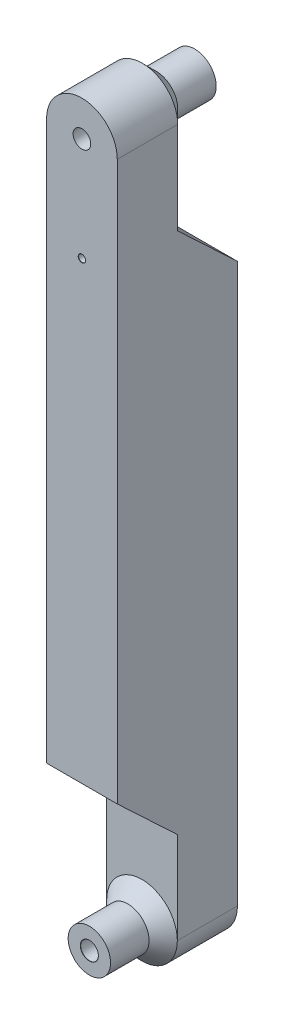
ISO-10303-21;
HEADER;
FILE_DESCRIPTION(('STEP AP214'),'2;1');
FILE_NAME('part.step','',(''),(''),'','','');
FILE_SCHEMA(('AUTOMOTIVE_DESIGN { 1 0 10303 214 1 1 1 1 }'));
ENDSEC;
DATA;
#1=APPLICATION_CONTEXT('core data for automotive mechanical design processes');
#2=APPLICATION_PROTOCOL_DEFINITION('international standard','automotive_design',2000,#1);
#3=PRODUCT_CONTEXT('',#1,'mechanical');
#4=PRODUCT('Part','Part','',(#3));
#5=PRODUCT_RELATED_PRODUCT_CATEGORY('part','',(#4));
#6=PRODUCT_DEFINITION_FORMATION('','',#4);
#7=PRODUCT_DEFINITION_CONTEXT('part definition',#1,'design');
#8=PRODUCT_DEFINITION('design','',#6,#7);
#9=PRODUCT_DEFINITION_SHAPE('','',#8);
#10=(LENGTH_UNIT() NAMED_UNIT(*) SI_UNIT(.MILLI.,.METRE.));
#11=(NAMED_UNIT(*) PLANE_ANGLE_UNIT() SI_UNIT($,.RADIAN.));
#12=(NAMED_UNIT(*) SI_UNIT($,.STERADIAN.) SOLID_ANGLE_UNIT());
#13=UNCERTAINTY_MEASURE_WITH_UNIT(LENGTH_MEASURE(1.E-05),#10,'distance_accuracy_value','');
#14=(GEOMETRIC_REPRESENTATION_CONTEXT(3) GLOBAL_UNCERTAINTY_ASSIGNED_CONTEXT((#13)) GLOBAL_UNIT_ASSIGNED_CONTEXT((#10,
#11,#12)) REPRESENTATION_CONTEXT('',''));
#15=CARTESIAN_POINT('',(0.,0.,0.));
#16=DIRECTION('',(0.,0.,1.));
#17=DIRECTION('',(1.,0.,0.));
#18=AXIS2_PLACEMENT_3D('',#15,#16,#17);
#19=CARTESIAN_POINT('',(0.,50.,-8.5));
#20=DIRECTION('',(0.,0.,-1.));
#21=DIRECTION('',(-1.,0.,0.));
#22=AXIS2_PLACEMENT_3D('',#19,#20,#21);
#23=PLANE('',#22);
#24=DIRECTION('',(1.,0.,0.));
#25=VECTOR('',#24,1.);
#26=CARTESIAN_POINT('',(-5.,29.,-8.5));
#27=LINE('',#26,#25);
#28=CARTESIAN_POINT('',(-5.,29.,-8.5));
#29=VERTEX_POINT('',#28);
#30=CARTESIAN_POINT('',(5.00000000000001,29.,-8.5));
#31=VERTEX_POINT('',#30);
#32=EDGE_CURVE('E135',#29,#31,#27,.T.);
#33=ORIENTED_EDGE('',*,*,#32,.T.);
#34=DIRECTION('',(0.,1.,0.));
#35=VECTOR('',#34,1.);
#36=CARTESIAN_POINT('',(5.00000000000001,-50.,-8.5));
#37=LINE('',#36,#35);
#38=CARTESIAN_POINT('',(5.00000000000001,-50.,-8.5));
#39=VERTEX_POINT('',#38);
#40=EDGE_CURVE('E167',#39,#31,#37,.T.);
#41=ORIENTED_EDGE('',*,*,#40,.F.);
#42=CARTESIAN_POINT('',(0.,-50.,-8.5));
#43=DIRECTION('',(0.,0.,1.));
#44=DIRECTION('',(-1.,0.,0.));
#45=AXIS2_PLACEMENT_3D('',#42,#43,#44);
#46=CIRCLE('',#45,5.);
#47=CARTESIAN_POINT('',(-4.99999999999999,-50.,-8.5));
#48=VERTEX_POINT('',#47);
#49=EDGE_CURVE('E173',#48,#39,#46,.T.);
#50=ORIENTED_EDGE('',*,*,#49,.F.);
#51=DIRECTION('',(0.,-1.,0.));
#52=VECTOR('',#51,1.);
#53=CARTESIAN_POINT('',(-4.99999999999999,-50.,-8.5));
#54=LINE('',#53,#52);
#55=EDGE_CURVE('E162',#29,#48,#54,.T.);
#56=ORIENTED_EDGE('',*,*,#55,.F.);
#57=EDGE_LOOP('',(#33,#41,#50,#56));
#58=FACE_BOUND('',#57,.T.);
#59=CARTESIAN_POINT('',(0.,-50.,-8.5));
#60=DIRECTION('',(0.,0.,1.));
#61=DIRECTION('',(1.,0.,0.));
#62=AXIS2_PLACEMENT_3D('',#59,#60,#61);
#63=CIRCLE('',#62,1.25);
#64=CARTESIAN_POINT('',(1.25,-50.,-8.5));
#65=VERTEX_POINT('',#64);
#66=EDGE_CURVE('E322',#65,#65,#63,.T.);
#67=ORIENTED_EDGE('',*,*,#66,.T.);
#68=EDGE_LOOP('',(#67));
#69=FACE_BOUND('',#68,.T.);
#70=ADVANCED_FACE('F41',(#58,#69),#23,.T.);
#71=CARTESIAN_POINT('',(0.,50.,8.5));
#72=DIRECTION('',(0.,0.,-1.));
#73=DIRECTION('',(-1.,0.,0.));
#74=AXIS2_PLACEMENT_3D('',#71,#72,#73);
#75=CYLINDRICAL_SURFACE('',#74,5.);
#76=DIRECTION('',(0.,0.,-1.));
#77=VECTOR('',#76,1.);
#78=CARTESIAN_POINT('',(5.00000000000001,50.,8.5));
#79=LINE('',#78,#77);
#80=CARTESIAN_POINT('',(5.00000000000001,50.,8.5));
#81=VERTEX_POINT('',#80);
#82=CARTESIAN_POINT('',(5.00000000000001,50.,-0.0500000000000066));
#83=VERTEX_POINT('',#82);
#84=EDGE_CURVE('E65',#81,#83,#79,.T.);
#85=ORIENTED_EDGE('',*,*,#84,.T.);
#86=CARTESIAN_POINT('',(0.,50.,-0.0500000000000079));
#87=DIRECTION('',(0.,0.,1.));
#88=DIRECTION('',(1.,0.,0.));
#89=AXIS2_PLACEMENT_3D('',#86,#87,#88);
#90=CIRCLE('',#89,5.);
#91=CARTESIAN_POINT('',(-4.99999999999999,50.,-0.0500000000000084));
#92=VERTEX_POINT('',#91);
#93=EDGE_CURVE('E200',#83,#92,#90,.T.);
#94=ORIENTED_EDGE('',*,*,#93,.T.);
#95=DIRECTION('',(0.,0.,-1.));
#96=VECTOR('',#95,1.);
#97=CARTESIAN_POINT('',(-4.99999999999999,50.,8.5));
#98=LINE('',#97,#96);
#99=CARTESIAN_POINT('',(-4.99999999999999,50.,8.5));
#100=VERTEX_POINT('',#99);
#101=EDGE_CURVE('E58',#100,#92,#98,.T.);
#102=ORIENTED_EDGE('',*,*,#101,.F.);
#103=CARTESIAN_POINT('',(0.,50.,8.5));
#104=DIRECTION('',(0.,0.,1.));
#105=DIRECTION('',(-1.,0.,0.));
#106=AXIS2_PLACEMENT_3D('',#103,#104,#105);
#107=CIRCLE('',#106,5.);
#108=EDGE_CURVE('E163',#81,#100,#107,.T.);
#109=ORIENTED_EDGE('',*,*,#108,.F.);
#110=EDGE_LOOP('',(#85,#94,#102,#109));
#111=FACE_BOUND('',#110,.T.);
#112=ADVANCED_FACE('F216',(#111),#75,.T.);
#113=CARTESIAN_POINT('',(-4.99999999999999,-50.,8.5));
#114=DIRECTION('',(1.,0.,0.));
#115=DIRECTION('',(0.,0.,-1.));
#116=AXIS2_PLACEMENT_3D('',#113,#114,#115);
#117=PLANE('',#116);
#118=ORIENTED_EDGE('',*,*,#101,.T.);
#119=CARTESIAN_POINT('',(-4.99999999999999,50.,-0.050000000000008));
#120=CARTESIAN_POINT('',(-4.99999999999999,49.9406950912656,-0.0500030855515016));
#121=CARTESIAN_POINT('',(-4.99999999999999,49.8813907917663,-0.0489448908370419));
#122=CARTESIAN_POINT('',(-4.99999999999999,49.7629290319382,-0.0447316902668953));
#123=CARTESIAN_POINT('',(-4.99999999999999,49.7037714807349,-0.0415792434171539));
#124=CARTESIAN_POINT('',(-4.99999999999999,49.5856050710497,-0.0332032684096867));
#125=CARTESIAN_POINT('',(-4.99999999999999,49.5265962094341,-0.0279797842740843));
#126=CARTESIAN_POINT('',(-4.99999999999999,49.4087204290817,-0.0155023969568519));
#127=CARTESIAN_POINT('',(-4.99999999999999,49.3498537716871,-0.00824602201829422));
#128=CARTESIAN_POINT('',(-4.99999999999999,49.2911276560621,0.));
#129=B_SPLINE_CURVE_WITH_KNOTS('',3,(#119,#120,#121,#122,#123,#124,#125,#126,#127,#128),
.UNSPECIFIED.,.F.,.F.,(4,2,2,2,4),(0.,0.177904351415449,0.355591717032738,0.533275305916565,
0.711175881922022),.UNSPECIFIED.);
#130=CARTESIAN_POINT('',(-5.,49.2911276560621,0.));
#131=VERTEX_POINT('',#130);
#132=EDGE_CURVE('E122',#92,#131,#129,.T.);
#133=ORIENTED_EDGE('',*,*,#132,.T.);
#134=DIRECTION('',(0.,-1.,0.));
#135=VECTOR('',#134,1.);
#136=CARTESIAN_POINT('',(-5.,55.,0.));
#137=LINE('',#136,#135);
#138=CARTESIAN_POINT('',(-5.,37.,0.));
#139=VERTEX_POINT('',#138);
#140=EDGE_CURVE('E114',#131,#139,#137,.T.);
#141=ORIENTED_EDGE('',*,*,#140,.T.);
#142=DIRECTION('',(0.,-0.685364699004991,-0.728199992692803));
#143=VECTOR('',#142,1.);
#144=CARTESIAN_POINT('',(-5.,37.,0.));
#145=LINE('',#144,#143);
#146=EDGE_CURVE('E119',#139,#29,#145,.T.);
#147=ORIENTED_EDGE('',*,*,#146,.T.);
#148=ORIENTED_EDGE('',*,*,#55,.T.);
#149=DIRECTION('',(0.,0.,-1.));
#150=VECTOR('',#149,1.);
#151=CARTESIAN_POINT('',(-4.99999999999999,-50.,8.5));
#152=LINE('',#151,#150);
#153=CARTESIAN_POINT('',(-5.,-50.,0.));
#154=VERTEX_POINT('',#153);
#155=EDGE_CURVE('E181',#154,#48,#152,.T.);
#156=ORIENTED_EDGE('',*,*,#155,.F.);
#157=DIRECTION('',(0.,1.,0.));
#158=VECTOR('',#157,1.);
#159=CARTESIAN_POINT('',(-5.,-37.,0.));
#160=LINE('',#159,#158);
#161=CARTESIAN_POINT('',(-5.,-37.,0.));
#162=VERTEX_POINT('',#161);
#163=EDGE_CURVE('E147',#154,#162,#160,.T.);
#164=ORIENTED_EDGE('',*,*,#163,.T.);
#165=DIRECTION('',(0.,0.685364699004991,0.728199992692803));
#166=VECTOR('',#165,1.);
#167=CARTESIAN_POINT('',(-5.,-29.,8.5));
#168=LINE('',#167,#166);
#169=CARTESIAN_POINT('',(-5.,-29.,8.5));
#170=VERTEX_POINT('',#169);
#171=EDGE_CURVE('E126',#162,#170,#168,.T.);
#172=ORIENTED_EDGE('',*,*,#171,.T.);
#173=DIRECTION('',(0.,-1.,0.));
#174=VECTOR('',#173,1.);
#175=CARTESIAN_POINT('',(-4.99999999999999,-50.,8.5));
#176=LINE('',#175,#174);
#177=EDGE_CURVE('E166',#100,#170,#176,.T.);
#178=ORIENTED_EDGE('',*,*,#177,.F.);
#179=EDGE_LOOP('',(#118,#133,#141,#147,#148,#156,#164,#172,#178));
#180=FACE_BOUND('',#179,.T.);
#181=ADVANCED_FACE('F116',(#180),#117,.F.);
#182=CARTESIAN_POINT('',(0.,-50.,8.5));
#183=DIRECTION('',(0.,0.,-1.));
#184=DIRECTION('',(-1.,0.,0.));
#185=AXIS2_PLACEMENT_3D('',#182,#183,#184);
#186=CYLINDRICAL_SURFACE('',#185,5.);
#187=DIRECTION('',(0.,0.,-1.));
#188=VECTOR('',#187,1.);
#189=CARTESIAN_POINT('',(5.00000000000001,-50.,8.5));
#190=LINE('',#189,#188);
#191=CARTESIAN_POINT('',(5.00000000000001,-50.,0.));
#192=VERTEX_POINT('',#191);
#193=EDGE_CURVE('E179',#192,#39,#190,.T.);
#194=ORIENTED_EDGE('',*,*,#193,.F.);
#195=CARTESIAN_POINT('',(0.,-50.,0.));
#196=DIRECTION('',(0.,0.,-1.));
#197=DIRECTION('',(-1.,0.,0.));
#198=AXIS2_PLACEMENT_3D('',#195,#196,#197);
#199=CIRCLE('',#198,5.);
#200=EDGE_CURVE('E160',#192,#154,#199,.T.);
#201=ORIENTED_EDGE('',*,*,#200,.T.);
#202=ORIENTED_EDGE('',*,*,#155,.T.);
#203=ORIENTED_EDGE('',*,*,#49,.T.);
#204=EDGE_LOOP('',(#194,#201,#202,#203));
#205=FACE_BOUND('',#204,.T.);
#206=ADVANCED_FACE('F226',(#205),#186,.T.);
#207=CARTESIAN_POINT('',(5.00000000000001,-50.,8.5));
#208=DIRECTION('',(-1.,0.,0.));
#209=DIRECTION('',(0.,0.,1.));
#210=AXIS2_PLACEMENT_3D('',#207,#208,#209);
#211=PLANE('',#210);
#212=ORIENTED_EDGE('',*,*,#40,.T.);
#213=DIRECTION('',(0.,0.685364699004991,0.728199992692803));
#214=VECTOR('',#213,1.);
#215=CARTESIAN_POINT('',(5.00000000000001,0.376146788990846,-38.9128440366972));
#216=LINE('',#215,#214);
#217=CARTESIAN_POINT('',(5.00000000000001,37.,0.));
#218=VERTEX_POINT('',#217);
#219=EDGE_CURVE('E142',#31,#218,#216,.T.);
#220=ORIENTED_EDGE('',*,*,#219,.T.);
#221=DIRECTION('',(0.,1.,0.));
#222=VECTOR('',#221,1.);
#223=CARTESIAN_POINT('',(5.00000000000001,-50.,0.));
#224=LINE('',#223,#222);
#225=CARTESIAN_POINT('',(5.00000000000001,49.2911276560621,0.));
#226=VERTEX_POINT('',#225);
#227=EDGE_CURVE('E132',#218,#226,#224,.T.);
#228=ORIENTED_EDGE('',*,*,#227,.T.);
#229=CARTESIAN_POINT('',(5.00000000000001,49.2911276560621,0.));
#230=CARTESIAN_POINT('',(5.00000000000001,49.3498537716871,-0.00824602201829095));
#231=CARTESIAN_POINT('',(5.00000000000001,49.4087204290817,-0.0155023969568488));
#232=CARTESIAN_POINT('',(5.00000000000001,49.5265962094341,-0.0279797842740822));
#233=CARTESIAN_POINT('',(5.00000000000001,49.5856050710497,-0.0332032684096852));
#234=CARTESIAN_POINT('',(5.00000000000001,49.7037714807349,-0.0415792434171498));
#235=CARTESIAN_POINT('',(5.00000000000001,49.7629290319382,-0.0447316902668882));
#236=CARTESIAN_POINT('',(5.00000000000001,49.8813907917663,-0.0489448908370436));
#237=CARTESIAN_POINT('',(5.00000000000001,49.9406950912656,-0.0500030855515152));
#238=CARTESIAN_POINT('',(5.00000000000001,50.,-0.0500000000000498));
#239=B_SPLINE_CURVE_WITH_KNOTS('',3,(#229,#230,#231,#232,#233,#234,#235,#236,#237,#238),
.UNSPECIFIED.,.F.,.F.,(4,2,2,2,4),(0.,0.177900576005443,0.355584164889276,0.533271530506559,
0.711175881922016),.UNSPECIFIED.);
#240=EDGE_CURVE('E193',#226,#83,#239,.T.);
#241=ORIENTED_EDGE('',*,*,#240,.T.);
#242=ORIENTED_EDGE('',*,*,#84,.F.);
#243=DIRECTION('',(0.,1.,0.));
#244=VECTOR('',#243,1.);
#245=CARTESIAN_POINT('',(5.00000000000001,-50.,8.5));
#246=LINE('',#245,#244);
#247=CARTESIAN_POINT('',(5.00000000000001,-29.,8.5));
#248=VERTEX_POINT('',#247);
#249=EDGE_CURVE('E170',#248,#81,#246,.T.);
#250=ORIENTED_EDGE('',*,*,#249,.F.);
#251=DIRECTION('',(0.,-0.685364699004991,-0.728199992692803));
#252=VECTOR('',#251,1.);
#253=CARTESIAN_POINT('',(5.00000000000001,-38.8642201834862,-1.98073394495412));
#254=LINE('',#253,#252);
#255=CARTESIAN_POINT('',(5.00000000000001,-37.,0.));
#256=VERTEX_POINT('',#255);
#257=EDGE_CURVE('E157',#248,#256,#254,.T.);
#258=ORIENTED_EDGE('',*,*,#257,.T.);
#259=DIRECTION('',(0.,-1.,0.));
#260=VECTOR('',#259,1.);
#261=CARTESIAN_POINT('',(5.00000000000001,-50.,0.));
#262=LINE('',#261,#260);
#263=EDGE_CURVE('E184',#256,#192,#262,.T.);
#264=ORIENTED_EDGE('',*,*,#263,.T.);
#265=ORIENTED_EDGE('',*,*,#193,.T.);
#266=EDGE_LOOP('',(#212,#220,#228,#241,#242,#250,#258,#264,#265));
#267=FACE_BOUND('',#266,.T.);
#268=ADVANCED_FACE('F202',(#267),#211,.F.);
#269=CARTESIAN_POINT('',(0.,50.,8.5));
#270=DIRECTION('',(0.,0.,-1.));
#271=DIRECTION('',(-1.,0.,0.));
#272=AXIS2_PLACEMENT_3D('',#269,#270,#271);
#273=PLANE('',#272);
#274=CARTESIAN_POINT('',(0.,35.349999910593,8.5));
#275=DIRECTION('',(0.,0.,1.));
#276=DIRECTION('',(1.,0.,0.));
#277=AXIS2_PLACEMENT_3D('',#274,#275,#276);
#278=CIRCLE('',#277,0.525);
#279=CARTESIAN_POINT('',(0.525000000000008,35.349999910593,8.5));
#280=VERTEX_POINT('',#279);
#281=EDGE_CURVE('E303',#280,#280,#278,.T.);
#282=ORIENTED_EDGE('',*,*,#281,.F.);
#283=EDGE_LOOP('',(#282));
#284=FACE_BOUND('',#283,.T.);
#285=CARTESIAN_POINT('',(0.,50.,8.5));
#286=DIRECTION('',(0.,0.,-1.));
#287=DIRECTION('',(-1.,0.,0.));
#288=AXIS2_PLACEMENT_3D('',#285,#286,#287);
#289=CIRCLE('',#288,1.25);
#290=CARTESIAN_POINT('',(-1.24999999999999,50.,8.5));
#291=VERTEX_POINT('',#290);
#292=EDGE_CURVE('E313',#291,#291,#289,.T.);
#293=ORIENTED_EDGE('',*,*,#292,.T.);
#294=EDGE_LOOP('',(#293));
#295=FACE_BOUND('',#294,.T.);
#296=ORIENTED_EDGE('',*,*,#177,.T.);
#297=DIRECTION('',(1.,0.,0.));
#298=VECTOR('',#297,1.);
#299=CARTESIAN_POINT('',(-5.,-29.,8.5));
#300=LINE('',#299,#298);
#301=EDGE_CURVE('E144',#170,#248,#300,.T.);
#302=ORIENTED_EDGE('',*,*,#301,.T.);
#303=ORIENTED_EDGE('',*,*,#249,.T.);
#304=ORIENTED_EDGE('',*,*,#108,.T.);
#305=EDGE_LOOP('',(#296,#302,#303,#304));
#306=FACE_BOUND('',#305,.T.);
#307=ADVANCED_FACE('F232',(#284,#295,#306),#273,.F.);
#308=CARTESIAN_POINT('',(-5.,55.,0.));
#309=DIRECTION('',(0.,0.,1.));
#310=DIRECTION('',(1.,0.,0.));
#311=AXIS2_PLACEMENT_3D('',#308,#309,#310);
#312=PLANE('',#311);
#313=ORIENTED_EDGE('',*,*,#140,.F.);
#314=CARTESIAN_POINT('',(0.,50.,0.));
#315=DIRECTION('',(0.,0.,1.));
#316=DIRECTION('',(1.,0.,0.));
#317=AXIS2_PLACEMENT_3D('',#314,#315,#316);
#318=CIRCLE('',#317,5.05000000000001);
#319=EDGE_CURVE('E191',#131,#226,#318,.T.);
#320=ORIENTED_EDGE('',*,*,#319,.T.);
#321=ORIENTED_EDGE('',*,*,#227,.F.);
#322=DIRECTION('',(1.,0.,0.));
#323=VECTOR('',#322,1.);
#324=CARTESIAN_POINT('',(-5.,37.,0.));
#325=LINE('',#324,#323);
#326=EDGE_CURVE('E129',#139,#218,#325,.T.);
#327=ORIENTED_EDGE('',*,*,#326,.F.);
#328=EDGE_LOOP('',(#313,#320,#321,#327));
#329=FACE_BOUND('',#328,.T.);
#330=ADVANCED_FACE('F130',(#329),#312,.F.);
#331=CARTESIAN_POINT('',(-5.,37.,0.));
#332=DIRECTION('',(0.,-0.728199992692803,0.685364699004991));
#333=DIRECTION('',(0.,-0.685364699004991,-0.728199992692803));
#334=AXIS2_PLACEMENT_3D('',#331,#332,#333);
#335=PLANE('',#334);
#336=CARTESIAN_POINT('',(0.,35.349999910593,-1.75312509499493));
#337=DIRECTION('',(0.,-0.728199992692803,0.685364699004991));
#338=DIRECTION('',(0.,0.685364699004991,0.728199992692803));
#339=AXIS2_PLACEMENT_3D('',#336,#337,#338);
#340=ELLIPSE('',#339,0.729538595620545,0.499999999999998);
#341=CARTESIAN_POINT('',(0.,35.849999910593,-1.22187509499494));
#342=VERTEX_POINT('',#341);
#343=EDGE_CURVE('E46',#342,#342,#340,.T.);
#344=ORIENTED_EDGE('',*,*,#343,.T.);
#345=EDGE_LOOP('',(#344));
#346=FACE_BOUND('',#345,.T.);
#347=ORIENTED_EDGE('',*,*,#32,.F.);
#348=ORIENTED_EDGE('',*,*,#146,.F.);
#349=ORIENTED_EDGE('',*,*,#326,.T.);
#350=ORIENTED_EDGE('',*,*,#219,.F.);
#351=EDGE_LOOP('',(#347,#348,#349,#350));
#352=FACE_BOUND('',#351,.T.);
#353=ADVANCED_FACE('F137',(#346,#352),#335,.F.);
#354=CARTESIAN_POINT('',(-5.,-37.,0.));
#355=DIRECTION('',(0.,0.,-1.));
#356=DIRECTION('',(-1.,0.,0.));
#357=AXIS2_PLACEMENT_3D('',#354,#355,#356);
#358=PLANE('',#357);
#359=ORIENTED_EDGE('',*,*,#163,.F.);
#360=CARTESIAN_POINT('',(0.,-50.,0.));
#361=DIRECTION('',(0.,0.,-1.));
#362=DIRECTION('',(-1.,0.,0.));
#363=AXIS2_PLACEMENT_3D('',#360,#361,#362);
#364=CIRCLE('',#363,4.99999999999998);
#365=EDGE_CURVE('E11',#154,#192,#364,.T.);
#366=ORIENTED_EDGE('',*,*,#365,.T.);
#367=ORIENTED_EDGE('',*,*,#263,.F.);
#368=DIRECTION('',(1.,0.,0.));
#369=VECTOR('',#368,1.);
#370=CARTESIAN_POINT('',(-5.,-37.,0.));
#371=LINE('',#370,#369);
#372=EDGE_CURVE('E148',#162,#256,#371,.T.);
#373=ORIENTED_EDGE('',*,*,#372,.F.);
#374=EDGE_LOOP('',(#359,#366,#367,#373));
#375=FACE_BOUND('',#374,.T.);
#376=ADVANCED_FACE('F245',(#375),#358,.F.);
#377=CARTESIAN_POINT('',(-5.,-29.,8.5));
#378=DIRECTION('',(0.,0.728199992692803,-0.685364699004991));
#379=DIRECTION('',(0.,0.685364699004991,0.728199992692803));
#380=AXIS2_PLACEMENT_3D('',#377,#378,#379);
#381=PLANE('',#380);
#382=ORIENTED_EDGE('',*,*,#301,.F.);
#383=ORIENTED_EDGE('',*,*,#171,.F.);
#384=ORIENTED_EDGE('',*,*,#372,.T.);
#385=ORIENTED_EDGE('',*,*,#257,.F.);
#386=EDGE_LOOP('',(#382,#383,#384,#385));
#387=FACE_BOUND('',#386,.T.);
#388=ADVANCED_FACE('F248',(#387),#381,.F.);
#389=CARTESIAN_POINT('',(0.,50.,-7.45));
#390=DIRECTION('',(0.,0.,1.));
#391=DIRECTION('',(1.,0.,0.));
#392=AXIS2_PLACEMENT_3D('',#389,#390,#391);
#393=CYLINDRICAL_SURFACE('',#392,3.05);
#394=CARTESIAN_POINT('',(0.,50.,-2.00000000000003));
#395=DIRECTION('',(0.,0.,1.));
#396=DIRECTION('',(1.,0.,0.));
#397=AXIS2_PLACEMENT_3D('',#394,#395,#396);
#398=CIRCLE('',#397,3.05);
#399=CARTESIAN_POINT('',(3.05,50.,-2.00000000000003));
#400=VERTEX_POINT('',#399);
#401=EDGE_CURVE('E188',#400,#400,#398,.F.);
#402=ORIENTED_EDGE('',*,*,#401,.T.);
#403=EDGE_LOOP('',(#402));
#404=FACE_BOUND('',#403,.T.);
#405=CARTESIAN_POINT('',(0.,50.,-7.45));
#406=DIRECTION('',(0.,0.,-1.));
#407=DIRECTION('',(-1.,0.,0.));
#408=AXIS2_PLACEMENT_3D('',#405,#406,#407);
#409=CIRCLE('',#408,3.05);
#410=CARTESIAN_POINT('',(-3.04999999999999,50.,-7.45));
#411=VERTEX_POINT('',#410);
#412=EDGE_CURVE('E151',#411,#411,#409,.T.);
#413=ORIENTED_EDGE('',*,*,#412,.F.);
#414=EDGE_LOOP('',(#413));
#415=FACE_BOUND('',#414,.T.);
#416=ADVANCED_FACE('F252',(#404,#415),#393,.T.);
#417=CARTESIAN_POINT('',(0.,50.,-7.45));
#418=DIRECTION('',(0.,0.,-1.));
#419=DIRECTION('',(-1.,0.,0.));
#420=AXIS2_PLACEMENT_3D('',#417,#418,#419);
#421=PLANE('',#420);
#422=CARTESIAN_POINT('',(0.,50.,-7.45));
#423=DIRECTION('',(0.,0.,-1.));
#424=DIRECTION('',(-1.,0.,0.));
#425=AXIS2_PLACEMENT_3D('',#422,#423,#424);
#426=CIRCLE('',#425,1.275);
#427=CARTESIAN_POINT('',(-1.27499999999999,50.,-7.45));
#428=VERTEX_POINT('',#427);
#429=EDGE_CURVE('E307',#428,#428,#426,.T.);
#430=ORIENTED_EDGE('',*,*,#429,.F.);
#431=EDGE_LOOP('',(#430));
#432=FACE_BOUND('',#431,.T.);
#433=ORIENTED_EDGE('',*,*,#412,.T.);
#434=EDGE_LOOP('',(#433));
#435=FACE_BOUND('',#434,.T.);
#436=ADVANCED_FACE('F214',(#432,#435),#421,.T.);
#437=CARTESIAN_POINT('',(0.,50.,-2.00000000000003));
#438=DIRECTION('',(0.,0.,1.));
#439=DIRECTION('',(1.,0.,0.));
#440=AXIS2_PLACEMENT_3D('',#437,#438,#439);
#441=CONICAL_SURFACE('',#440,3.05,0.785398163397443);
#442=ORIENTED_EDGE('',*,*,#240,.F.);
#443=ORIENTED_EDGE('',*,*,#319,.F.);
#444=ORIENTED_EDGE('',*,*,#132,.F.);
#445=ORIENTED_EDGE('',*,*,#93,.F.);
#446=EDGE_LOOP('',(#442,#443,#444,#445));
#447=FACE_BOUND('',#446,.T.);
#448=ORIENTED_EDGE('',*,*,#401,.F.);
#449=EDGE_LOOP('',(#448));
#450=FACE_BOUND('',#449,.T.);
#451=ADVANCED_FACE('F207',(#447,#450),#441,.T.);
#452=CARTESIAN_POINT('',(0.,-50.,7.45));
#453=DIRECTION('',(0.,0.,-1.));
#454=DIRECTION('',(-1.,0.,0.));
#455=AXIS2_PLACEMENT_3D('',#452,#453,#454);
#456=CYLINDRICAL_SURFACE('',#455,3.);
#457=CARTESIAN_POINT('',(0.,-50.,1.99999999999998));
#458=DIRECTION('',(0.,0.,-1.));
#459=DIRECTION('',(-1.,0.,0.));
#460=AXIS2_PLACEMENT_3D('',#457,#458,#459);
#461=CIRCLE('',#460,3.);
#462=CARTESIAN_POINT('',(-3.,-50.,1.99999999999998));
#463=VERTEX_POINT('',#462);
#464=EDGE_CURVE('E51',#463,#463,#461,.F.);
#465=ORIENTED_EDGE('',*,*,#464,.T.);
#466=EDGE_LOOP('',(#465));
#467=FACE_BOUND('',#466,.T.);
#468=CARTESIAN_POINT('',(0.,-50.,7.45));
#469=DIRECTION('',(0.,0.,1.));
#470=DIRECTION('',(1.,0.,0.));
#471=AXIS2_PLACEMENT_3D('',#468,#469,#470);
#472=CIRCLE('',#471,3.);
#473=CARTESIAN_POINT('',(3.00000000000001,-50.,7.45));
#474=VERTEX_POINT('',#473);
#475=EDGE_CURVE('E325',#474,#474,#472,.T.);
#476=ORIENTED_EDGE('',*,*,#475,.F.);
#477=EDGE_LOOP('',(#476));
#478=FACE_BOUND('',#477,.T.);
#479=ADVANCED_FACE('F213',(#467,#478),#456,.T.);
#480=CARTESIAN_POINT('',(0.,-50.,7.45));
#481=DIRECTION('',(0.,0.,1.));
#482=DIRECTION('',(1.,0.,0.));
#483=AXIS2_PLACEMENT_3D('',#480,#481,#482);
#484=PLANE('',#483);
#485=CARTESIAN_POINT('',(0.,-50.,7.45));
#486=DIRECTION('',(0.,0.,1.));
#487=DIRECTION('',(1.,0.,0.));
#488=AXIS2_PLACEMENT_3D('',#485,#486,#487);
#489=CIRCLE('',#488,1.275);
#490=CARTESIAN_POINT('',(1.27500000000001,-50.,7.45));
#491=VERTEX_POINT('',#490);
#492=EDGE_CURVE('E316',#491,#491,#489,.T.);
#493=ORIENTED_EDGE('',*,*,#492,.F.);
#494=EDGE_LOOP('',(#493));
#495=FACE_BOUND('',#494,.T.);
#496=ORIENTED_EDGE('',*,*,#475,.T.);
#497=EDGE_LOOP('',(#496));
#498=FACE_BOUND('',#497,.T.);
#499=ADVANCED_FACE('F267',(#495,#498),#484,.T.);
#500=CARTESIAN_POINT('',(0.,-50.,1.99999999999998));
#501=DIRECTION('',(0.,0.,-1.));
#502=DIRECTION('',(-1.,0.,0.));
#503=AXIS2_PLACEMENT_3D('',#500,#501,#502);
#504=CONICAL_SURFACE('',#503,3.,0.785398163397446);
#505=ORIENTED_EDGE('',*,*,#200,.F.);
#506=ORIENTED_EDGE('',*,*,#365,.F.);
#507=EDGE_LOOP('',(#505,#506));
#508=FACE_BOUND('',#507,.T.);
#509=ORIENTED_EDGE('',*,*,#464,.F.);
#510=EDGE_LOOP('',(#509));
#511=FACE_BOUND('',#510,.T.);
#512=ADVANCED_FACE('F44',(#508,#511),#504,.T.);
#513=CARTESIAN_POINT('',(0.,-50.,7.45));
#514=DIRECTION('',(0.,0.,1.));
#515=DIRECTION('',(1.,0.,0.));
#516=AXIS2_PLACEMENT_3D('',#513,#514,#515);
#517=CYLINDRICAL_SURFACE('',#516,1.24999999999999);
#518=ORIENTED_EDGE('',*,*,#66,.F.);
#519=EDGE_LOOP('',(#518));
#520=FACE_BOUND('',#519,.T.);
#521=CARTESIAN_POINT('',(0.,-50.,7.42499999999997));
#522=DIRECTION('',(0.,0.,1.));
#523=DIRECTION('',(1.,0.,0.));
#524=AXIS2_PLACEMENT_3D('',#521,#522,#523);
#525=CIRCLE('',#524,1.24999999999999);
#526=CARTESIAN_POINT('',(1.24999999999999,-50.,7.42499999999997));
#527=VERTEX_POINT('',#526);
#528=EDGE_CURVE('E319',#527,#527,#525,.T.);
#529=ORIENTED_EDGE('',*,*,#528,.T.);
#530=EDGE_LOOP('',(#529));
#531=FACE_BOUND('',#530,.T.);
#532=ADVANCED_FACE('F272',(#520,#531),#517,.F.);
#533=CARTESIAN_POINT('',(0.,-50.,7.45));
#534=DIRECTION('',(0.,0.,1.));
#535=DIRECTION('',(1.,0.,0.));
#536=AXIS2_PLACEMENT_3D('',#533,#534,#535);
#537=CONICAL_SURFACE('',#536,1.275,0.785398163397171);
#538=ORIENTED_EDGE('',*,*,#528,.F.);
#539=EDGE_LOOP('',(#538));
#540=FACE_BOUND('',#539,.T.);
#541=ORIENTED_EDGE('',*,*,#492,.T.);
#542=EDGE_LOOP('',(#541));
#543=FACE_BOUND('',#542,.T.);
#544=ADVANCED_FACE('F275',(#540,#543),#537,.F.);
#545=CARTESIAN_POINT('',(0.,50.,-7.45));
#546=DIRECTION('',(0.,0.,-1.));
#547=DIRECTION('',(-1.,0.,0.));
#548=AXIS2_PLACEMENT_3D('',#545,#546,#547);
#549=CYLINDRICAL_SURFACE('',#548,1.24999999999999);
#550=ORIENTED_EDGE('',*,*,#292,.F.);
#551=EDGE_LOOP('',(#550));
#552=FACE_BOUND('',#551,.T.);
#553=CARTESIAN_POINT('',(0.,50.,-7.42499999999997));
#554=DIRECTION('',(0.,0.,-1.));
#555=DIRECTION('',(-1.,0.,0.));
#556=AXIS2_PLACEMENT_3D('',#553,#554,#555);
#557=CIRCLE('',#556,1.24999999999999);
#558=CARTESIAN_POINT('',(-1.24999999999998,50.,-7.42499999999997));
#559=VERTEX_POINT('',#558);
#560=EDGE_CURVE('E310',#559,#559,#557,.T.);
#561=ORIENTED_EDGE('',*,*,#560,.T.);
#562=EDGE_LOOP('',(#561));
#563=FACE_BOUND('',#562,.T.);
#564=ADVANCED_FACE('F279',(#552,#563),#549,.F.);
#565=CARTESIAN_POINT('',(0.,50.,-7.45));
#566=DIRECTION('',(0.,0.,-1.));
#567=DIRECTION('',(-1.,0.,0.));
#568=AXIS2_PLACEMENT_3D('',#565,#566,#567);
#569=CONICAL_SURFACE('',#568,1.275,0.785398163397171);
#570=ORIENTED_EDGE('',*,*,#560,.F.);
#571=EDGE_LOOP('',(#570));
#572=FACE_BOUND('',#571,.T.);
#573=ORIENTED_EDGE('',*,*,#429,.T.);
#574=EDGE_LOOP('',(#573));
#575=FACE_BOUND('',#574,.T.);
#576=ADVANCED_FACE('F283',(#572,#575),#569,.F.);
#577=CARTESIAN_POINT('',(0.,35.349999910593,8.5));
#578=DIRECTION('',(0.,0.,1.));
#579=DIRECTION('',(1.,0.,0.));
#580=AXIS2_PLACEMENT_3D('',#577,#578,#579);
#581=CYLINDRICAL_SURFACE('',#580,0.499999999999998);
#582=CARTESIAN_POINT('',(0.,35.349999910593,8.475));
#583=DIRECTION('',(0.,0.,1.));
#584=DIRECTION('',(1.,0.,0.));
#585=AXIS2_PLACEMENT_3D('',#582,#583,#584);
#586=CIRCLE('',#585,0.499999999999999);
#587=CARTESIAN_POINT('',(0.500000000000007,35.349999910593,8.475));
#588=VERTEX_POINT('',#587);
#589=EDGE_CURVE('E300',#588,#588,#586,.T.);
#590=ORIENTED_EDGE('',*,*,#589,.T.);
#591=EDGE_LOOP('',(#590));
#592=FACE_BOUND('',#591,.T.);
#593=ORIENTED_EDGE('',*,*,#343,.F.);
#594=EDGE_LOOP('',(#593));
#595=FACE_BOUND('',#594,.T.);
#596=ADVANCED_FACE('F287',(#592,#595),#581,.F.);
#597=CARTESIAN_POINT('',(0.,35.349999910593,8.5));
#598=DIRECTION('',(0.,0.,1.));
#599=DIRECTION('',(1.,0.,0.));
#600=AXIS2_PLACEMENT_3D('',#597,#598,#599);
#601=CONICAL_SURFACE('',#600,0.525,0.785398163397448);
#602=ORIENTED_EDGE('',*,*,#589,.F.);
#603=EDGE_LOOP('',(#602));
#604=FACE_BOUND('',#603,.T.);
#605=ORIENTED_EDGE('',*,*,#281,.T.);
#606=EDGE_LOOP('',(#605));
#607=FACE_BOUND('',#606,.T.);
#608=ADVANCED_FACE('F291',(#604,#607),#601,.F.);
#609=CLOSED_SHELL('',(#70,#112,#181,#206,#268,#307,#330,#353,#376,#388,#416,#436,#451,#479,#499,
#512,#532,#544,#564,#576,#596,#608));
#610=MANIFOLD_SOLID_BREP('B2',#609);
#611=ADVANCED_BREP_SHAPE_REPRESENTATION('',(#18,#610),#14);
#612=SHAPE_DEFINITION_REPRESENTATION(#9,#611);
ENDSEC;
END-ISO-10303-21;
